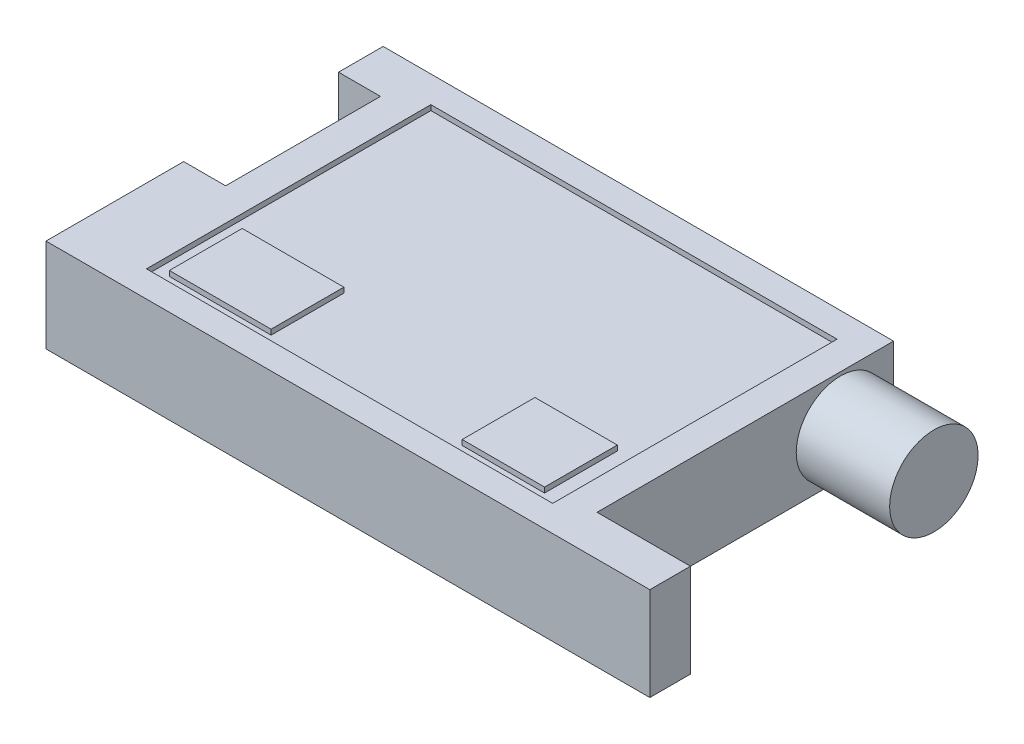
ISO-10303-21;
HEADER;
FILE_DESCRIPTION(('STEP AP214'),'2;1');
FILE_NAME('part.step','',(''),(''),'','','');
FILE_SCHEMA(('AUTOMOTIVE_DESIGN { 1 0 10303 214 1 1 1 1 }'));
ENDSEC;
DATA;
#1=APPLICATION_CONTEXT('core data for automotive mechanical design processes');
#2=APPLICATION_PROTOCOL_DEFINITION('international standard','automotive_design',2000,#1);
#3=PRODUCT_CONTEXT('',#1,'mechanical');
#4=PRODUCT('Part','Part','',(#3));
#5=PRODUCT_RELATED_PRODUCT_CATEGORY('part','',(#4));
#6=PRODUCT_DEFINITION_FORMATION('','',#4);
#7=PRODUCT_DEFINITION_CONTEXT('part definition',#1,'design');
#8=PRODUCT_DEFINITION('design','',#6,#7);
#9=PRODUCT_DEFINITION_SHAPE('','',#8);
#10=(LENGTH_UNIT() NAMED_UNIT(*) SI_UNIT(.MILLI.,.METRE.));
#11=(NAMED_UNIT(*) PLANE_ANGLE_UNIT() SI_UNIT($,.RADIAN.));
#12=(NAMED_UNIT(*) SI_UNIT($,.STERADIAN.) SOLID_ANGLE_UNIT());
#13=UNCERTAINTY_MEASURE_WITH_UNIT(LENGTH_MEASURE(1.E-05),#10,'distance_accuracy_value','');
#14=(GEOMETRIC_REPRESENTATION_CONTEXT(3) GLOBAL_UNCERTAINTY_ASSIGNED_CONTEXT((#13)) GLOBAL_UNIT_ASSIGNED_CONTEXT((#10,
#11,#12)) REPRESENTATION_CONTEXT('',''));
#15=CARTESIAN_POINT('',(0.,0.,0.));
#16=DIRECTION('',(0.,0.,1.));
#17=DIRECTION('',(1.,0.,0.));
#18=AXIS2_PLACEMENT_3D('',#15,#16,#17);
#19=CARTESIAN_POINT('',(0.,17.,0.));
#20=DIRECTION('',(0.,1.,0.));
#21=DIRECTION('',(0.,0.,1.));
#22=AXIS2_PLACEMENT_3D('',#19,#20,#21);
#23=PLANE('',#22);
#24=DIRECTION('',(1.,0.,0.));
#25=VECTOR('',#24,1.);
#26=CARTESIAN_POINT('',(17.5789290937729,17.,29.5927028688254));
#27=LINE('',#26,#25);
#28=CARTESIAN_POINT('',(17.5789290937729,17.,29.5927028688254));
#29=VERTEX_POINT('',#28);
#30=CARTESIAN_POINT('',(33.4416147487104,17.,29.5927028688254));
#31=VERTEX_POINT('',#30);
#32=EDGE_CURVE('E284',#29,#31,#27,.T.);
#33=ORIENTED_EDGE('',*,*,#32,.F.);
#34=DIRECTION('',(0.,0.,1.));
#35=VECTOR('',#34,1.);
#36=CARTESIAN_POINT('',(17.5789290937729,17.,15.578617873814));
#37=LINE('',#36,#35);
#38=CARTESIAN_POINT('',(17.5789290937729,17.,15.578617873814));
#39=VERTEX_POINT('',#38);
#40=EDGE_CURVE('E288',#39,#29,#37,.T.);
#41=ORIENTED_EDGE('',*,*,#40,.F.);
#42=DIRECTION('',(-1.,0.,0.));
#43=VECTOR('',#42,1.);
#44=CARTESIAN_POINT('',(17.5789290937729,17.,15.578617873814));
#45=LINE('',#44,#43);
#46=CARTESIAN_POINT('',(33.4416147487104,17.,15.578617873814));
#47=VERTEX_POINT('',#46);
#48=EDGE_CURVE('E276',#47,#39,#45,.T.);
#49=ORIENTED_EDGE('',*,*,#48,.F.);
#50=DIRECTION('',(0.,0.,-1.));
#51=VECTOR('',#50,1.);
#52=CARTESIAN_POINT('',(33.4416147487104,17.,15.578617873814));
#53=LINE('',#52,#51);
#54=EDGE_CURVE('E281',#31,#47,#53,.T.);
#55=ORIENTED_EDGE('',*,*,#54,.F.);
#56=EDGE_LOOP('',(#33,#41,#49,#55));
#57=FACE_BOUND('',#56,.T.);
#58=DIRECTION('',(-1.,0.,0.));
#59=VECTOR('',#58,1.);
#60=CARTESIAN_POINT('',(36.9450448076449,17.,-23.2440073529006));
#61=LINE('',#60,#59);
#62=CARTESIAN_POINT('',(36.9450448076449,17.,-23.2440073529006));
#63=VERTEX_POINT('',#62);
#64=CARTESIAN_POINT('',(-41.2893289979763,17.,-23.2440073529006));
#65=VERTEX_POINT('',#64);
#66=EDGE_CURVE('E308',#63,#65,#61,.T.);
#67=ORIENTED_EDGE('',*,*,#66,.T.);
#68=DIRECTION('',(0.,0.,1.));
#69=VECTOR('',#68,1.);
#70=CARTESIAN_POINT('',(-41.2893289979763,17.,-23.2440073529006));
#71=LINE('',#70,#69);
#72=CARTESIAN_POINT('',(-41.2893289979763,17.,31.5330929683171));
#73=VERTEX_POINT('',#72);
#74=EDGE_CURVE('E311',#65,#73,#71,.T.);
#75=ORIENTED_EDGE('',*,*,#74,.T.);
#76=DIRECTION('',(1.,0.,0.));
#77=VECTOR('',#76,1.);
#78=CARTESIAN_POINT('',(-41.2893289979763,17.,31.5330929683171));
#79=LINE('',#78,#77);
#80=CARTESIAN_POINT('',(36.9450448076449,17.,31.5330929683171));
#81=VERTEX_POINT('',#80);
#82=EDGE_CURVE('E315',#73,#81,#79,.T.);
#83=ORIENTED_EDGE('',*,*,#82,.T.);
#84=DIRECTION('',(0.,0.,-1.));
#85=VECTOR('',#84,1.);
#86=CARTESIAN_POINT('',(36.9450448076449,17.,31.5330929683171));
#87=LINE('',#86,#85);
#88=EDGE_CURVE('E318',#81,#63,#87,.T.);
#89=ORIENTED_EDGE('',*,*,#88,.T.);
#90=EDGE_LOOP('',(#67,#75,#83,#89));
#91=FACE_BOUND('',#90,.T.);
#92=DIRECTION('',(1.,0.,0.));
#93=VECTOR('',#92,1.);
#94=CARTESIAN_POINT('',(-38.8119047969582,17.,29.5927028688254));
#95=LINE('',#94,#93);
#96=CARTESIAN_POINT('',(-38.8119047969582,17.,29.5927028688254));
#97=VERTEX_POINT('',#96);
#98=CARTESIAN_POINT('',(-19.2267090731946,17.,29.5927028688254));
#99=VERTEX_POINT('',#98);
#100=EDGE_CURVE('E252',#97,#99,#95,.T.);
#101=ORIENTED_EDGE('',*,*,#100,.F.);
#102=DIRECTION('',(0.,0.,1.));
#103=VECTOR('',#102,1.);
#104=CARTESIAN_POINT('',(-38.8119047969582,17.,15.578617873814));
#105=LINE('',#104,#103);
#106=CARTESIAN_POINT('',(-38.8119047969582,17.,15.578617873814));
#107=VERTEX_POINT('',#106);
#108=EDGE_CURVE('E256',#107,#97,#105,.T.);
#109=ORIENTED_EDGE('',*,*,#108,.F.);
#110=DIRECTION('',(-1.,0.,0.));
#111=VECTOR('',#110,1.);
#112=CARTESIAN_POINT('',(-38.8119047969582,17.,15.578617873814));
#113=LINE('',#112,#111);
#114=CARTESIAN_POINT('',(-19.2267090731946,17.,15.578617873814));
#115=VERTEX_POINT('',#114);
#116=EDGE_CURVE('E244',#115,#107,#113,.T.);
#117=ORIENTED_EDGE('',*,*,#116,.F.);
#118=DIRECTION('',(0.,0.,-1.));
#119=VECTOR('',#118,1.);
#120=CARTESIAN_POINT('',(-19.2267090731946,17.,15.578617873814));
#121=LINE('',#120,#119);
#122=EDGE_CURVE('E249',#99,#115,#121,.T.);
#123=ORIENTED_EDGE('',*,*,#122,.F.);
#124=EDGE_LOOP('',(#101,#109,#117,#123));
#125=FACE_BOUND('',#124,.T.);
#126=ADVANCED_FACE('F33',(#57,#91,#125),#23,.T.);
#127=CARTESIAN_POINT('',(42.7052642554107,18.,-13.7559643184414));
#128=DIRECTION('',(-1.,0.,0.));
#129=DIRECTION('',(0.,0.,1.));
#130=AXIS2_PLACEMENT_3D('',#127,#128,#129);
#131=PLANE('',#130);
#132=DIRECTION('',(0.,0.,-1.));
#133=VECTOR('',#132,1.);
#134=CARTESIAN_POINT('',(42.7052642554107,0.,-13.7559643184414));
#135=LINE('',#134,#133);
#136=CARTESIAN_POINT('',(42.7052642554107,0.,28.7484593649253));
#137=VERTEX_POINT('',#136);
#138=CARTESIAN_POINT('',(42.7052642554107,0.,-28.3587111053649));
#139=VERTEX_POINT('',#138);
#140=EDGE_CURVE('E347',#137,#139,#135,.T.);
#141=ORIENTED_EDGE('',*,*,#140,.T.);
#142=DIRECTION('',(0.,-1.,0.));
#143=VECTOR('',#142,1.);
#144=CARTESIAN_POINT('',(42.7052642554107,18.,-28.3587111053649));
#145=LINE('',#144,#143);
#146=CARTESIAN_POINT('',(42.7052642554107,18.,-28.3587111053649));
#147=VERTEX_POINT('',#146);
#148=EDGE_CURVE('E365',#147,#139,#145,.T.);
#149=ORIENTED_EDGE('',*,*,#148,.F.);
#150=DIRECTION('',(0.,0.,-1.));
#151=VECTOR('',#150,1.);
#152=CARTESIAN_POINT('',(42.7052642554107,18.,28.7484593649253));
#153=LINE('',#152,#151);
#154=CARTESIAN_POINT('',(42.7052642554107,18.,28.7484593649253));
#155=VERTEX_POINT('',#154);
#156=EDGE_CURVE('E363',#155,#147,#153,.T.);
#157=ORIENTED_EDGE('',*,*,#156,.F.);
#158=DIRECTION('',(0.,-1.,0.));
#159=VECTOR('',#158,1.);
#160=CARTESIAN_POINT('',(42.7052642554107,18.,28.7484593649253));
#161=LINE('',#160,#159);
#162=EDGE_CURVE('E389',#155,#137,#161,.T.);
#163=ORIENTED_EDGE('',*,*,#162,.T.);
#164=EDGE_LOOP('',(#141,#149,#157,#163));
#165=FACE_BOUND('',#164,.T.);
#166=CARTESIAN_POINT('',(42.7052642554107,8.78099840539903,-18.1337047867629));
#167=DIRECTION('',(-1.,0.,0.));
#168=DIRECTION('',(0.,0.,1.));
#169=AXIS2_PLACEMENT_3D('',#166,#167,#168);
#170=CIRCLE('',#169,8.51668052111273);
#171=CARTESIAN_POINT('',(42.7052642554107,8.78099840539903,-9.61702426565018));
#172=VERTEX_POINT('',#171);
#173=EDGE_CURVE('E11',#172,#172,#170,.F.);
#174=ORIENTED_EDGE('',*,*,#173,.F.);
#175=EDGE_LOOP('',(#174));
#176=FACE_BOUND('',#175,.T.);
#177=ADVANCED_FACE('F436',(#165,#176),#131,.F.);
#178=CARTESIAN_POINT('',(42.7052642554107,18.,-28.3587111053649));
#179=DIRECTION('',(0.,0.,1.));
#180=DIRECTION('',(1.,0.,0.));
#181=AXIS2_PLACEMENT_3D('',#178,#179,#180);
#182=PLANE('',#181);
#183=DIRECTION('',(1.,0.,0.));
#184=VECTOR('',#183,1.);
#185=CARTESIAN_POINT('',(-47.5188498209383,4.02090009423084,-28.3587111053649));
#186=LINE('',#185,#184);
#187=CARTESIAN_POINT('',(-51.6294098232208,4.02090009423084,-28.3587111053649));
#188=VERTEX_POINT('',#187);
#189=CARTESIAN_POINT('',(-47.5188498209383,4.02090009423084,-28.3587111053649));
#190=VERTEX_POINT('',#189);
#191=EDGE_CURVE('E219',#188,#190,#186,.T.);
#192=ORIENTED_EDGE('',*,*,#191,.T.);
#193=DIRECTION('',(0.,1.,0.));
#194=VECTOR('',#193,1.);
#195=CARTESIAN_POINT('',(-47.5188498209383,4.02090009423084,-28.3587111053649));
#196=LINE('',#195,#194);
#197=CARTESIAN_POINT('',(-47.5188498209383,13.4253877681134,-28.3587111053649));
#198=VERTEX_POINT('',#197);
#199=EDGE_CURVE('E210',#190,#198,#196,.T.);
#200=ORIENTED_EDGE('',*,*,#199,.T.);
#201=DIRECTION('',(-1.,0.,0.));
#202=VECTOR('',#201,1.);
#203=CARTESIAN_POINT('',(-47.5188498209383,13.4253877681134,-28.3587111053649));
#204=LINE('',#203,#202);
#205=CARTESIAN_POINT('',(-51.6294098232208,13.4253877681134,-28.3587111053649));
#206=VERTEX_POINT('',#205);
#207=EDGE_CURVE('E222',#198,#206,#204,.T.);
#208=ORIENTED_EDGE('',*,*,#207,.T.);
#209=DIRECTION('',(0.,-1.,0.));
#210=VECTOR('',#209,1.);
#211=CARTESIAN_POINT('',(-51.6294098232208,4.02090009423084,-28.3587111053649));
#212=LINE('',#211,#210);
#213=EDGE_CURVE('E48',#206,#188,#212,.T.);
#214=ORIENTED_EDGE('',*,*,#213,.T.);
#215=EDGE_LOOP('',(#192,#200,#208,#214));
#216=FACE_BOUND('',#215,.T.);
#217=DIRECTION('',(-1.,0.,0.));
#218=VECTOR('',#217,1.);
#219=CARTESIAN_POINT('',(42.7052642554107,0.,-28.3587111053649));
#220=LINE('',#219,#218);
#221=CARTESIAN_POINT('',(-55.6025132208424,0.,-28.3587111053649));
#222=VERTEX_POINT('',#221);
#223=EDGE_CURVE('E342',#139,#222,#220,.T.);
#224=ORIENTED_EDGE('',*,*,#223,.T.);
#225=DIRECTION('',(0.,-1.,0.));
#226=VECTOR('',#225,1.);
#227=CARTESIAN_POINT('',(-55.6025132208424,18.,-28.3587111053649));
#228=LINE('',#227,#226);
#229=CARTESIAN_POINT('',(-55.6025132208424,18.,-28.3587111053649));
#230=VERTEX_POINT('',#229);
#231=EDGE_CURVE('E41',#230,#222,#228,.T.);
#232=ORIENTED_EDGE('',*,*,#231,.F.);
#233=DIRECTION('',(-1.,0.,0.));
#234=VECTOR('',#233,1.);
#235=CARTESIAN_POINT('',(42.7052642554107,18.,-28.3587111053649));
#236=LINE('',#235,#234);
#237=EDGE_CURVE('E343',#147,#230,#236,.T.);
#238=ORIENTED_EDGE('',*,*,#237,.F.);
#239=ORIENTED_EDGE('',*,*,#148,.T.);
#240=EDGE_LOOP('',(#224,#232,#238,#239));
#241=FACE_BOUND('',#240,.T.);
#242=ADVANCED_FACE('F35',(#216,#241),#182,.F.);
#243=CARTESIAN_POINT('',(-55.6025132208424,18.,-28.3587111053649));
#244=DIRECTION('',(1.,0.,0.));
#245=DIRECTION('',(0.,0.,-1.));
#246=AXIS2_PLACEMENT_3D('',#243,#244,#245);
#247=PLANE('',#246);
#248=DIRECTION('',(0.,0.,1.));
#249=VECTOR('',#248,1.);
#250=CARTESIAN_POINT('',(-55.6025132208424,0.,-28.3587111053649));
#251=LINE('',#250,#249);
#252=CARTESIAN_POINT('',(-55.6025132208424,0.,-19.7685554486213));
#253=VERTEX_POINT('',#252);
#254=EDGE_CURVE('E368',#222,#253,#251,.T.);
#255=ORIENTED_EDGE('',*,*,#254,.T.);
#256=DIRECTION('',(0.,-1.,0.));
#257=VECTOR('',#256,1.);
#258=CARTESIAN_POINT('',(-55.6025132208424,18.,-19.7685554486213));
#259=LINE('',#258,#257);
#260=CARTESIAN_POINT('',(-55.6025132208424,18.,-19.7685554486213));
#261=VERTEX_POINT('',#260);
#262=EDGE_CURVE('E409',#261,#253,#259,.T.);
#263=ORIENTED_EDGE('',*,*,#262,.F.);
#264=DIRECTION('',(0.,0.,1.));
#265=VECTOR('',#264,1.);
#266=CARTESIAN_POINT('',(-55.6025132208424,18.,-28.3587111053649));
#267=LINE('',#266,#265);
#268=EDGE_CURVE('E346',#230,#261,#267,.T.);
#269=ORIENTED_EDGE('',*,*,#268,.F.);
#270=ORIENTED_EDGE('',*,*,#231,.T.);
#271=EDGE_LOOP('',(#255,#263,#269,#270));
#272=FACE_BOUND('',#271,.T.);
#273=ADVANCED_FACE('F414',(#272),#247,.F.);
#274=CARTESIAN_POINT('',(-55.6025132208424,18.,-19.7685554486213));
#275=DIRECTION('',(0.,0.,-1.));
#276=DIRECTION('',(-1.,0.,0.));
#277=AXIS2_PLACEMENT_3D('',#274,#275,#276);
#278=PLANE('',#277);
#279=DIRECTION('',(0.,-1.,0.));
#280=VECTOR('',#279,1.);
#281=CARTESIAN_POINT('',(-47.5188498209383,18.,-19.7685554486213));
#282=LINE('',#281,#280);
#283=CARTESIAN_POINT('',(-47.5188498209383,4.02090009423084,-19.7685554486213));
#284=VERTEX_POINT('',#283);
#285=CARTESIAN_POINT('',(-47.5188498209383,0.,-19.7685554486213));
#286=VERTEX_POINT('',#285);
#287=EDGE_CURVE('E407',#284,#286,#282,.T.);
#288=ORIENTED_EDGE('',*,*,#287,.F.);
#289=DIRECTION('',(1.,0.,0.));
#290=VECTOR('',#289,1.);
#291=CARTESIAN_POINT('',(-47.5188498209383,4.02090009423084,-19.7685554486213));
#292=LINE('',#291,#290);
#293=CARTESIAN_POINT('',(-51.6294098232208,4.02090009423084,-19.7685554486213));
#294=VERTEX_POINT('',#293);
#295=EDGE_CURVE('E56',#294,#284,#292,.T.);
#296=ORIENTED_EDGE('',*,*,#295,.F.);
#297=DIRECTION('',(0.,-1.,0.));
#298=VECTOR('',#297,1.);
#299=CARTESIAN_POINT('',(-51.6294098232208,4.02090009423084,-19.7685554486213));
#300=LINE('',#299,#298);
#301=CARTESIAN_POINT('',(-51.6294098232208,13.4253877681134,-19.7685554486213));
#302=VERTEX_POINT('',#301);
#303=EDGE_CURVE('E229',#302,#294,#300,.T.);
#304=ORIENTED_EDGE('',*,*,#303,.F.);
#305=DIRECTION('',(-1.,0.,0.));
#306=VECTOR('',#305,1.);
#307=CARTESIAN_POINT('',(-47.5188498209383,13.4253877681134,-19.7685554486213));
#308=LINE('',#307,#306);
#309=CARTESIAN_POINT('',(-47.5188498209383,13.4253877681134,-19.7685554486213));
#310=VERTEX_POINT('',#309);
#311=EDGE_CURVE('E234',#310,#302,#308,.T.);
#312=ORIENTED_EDGE('',*,*,#311,.F.);
#313=CARTESIAN_POINT('',(-47.5188498209383,18.,-19.7685554486213));
#314=VERTEX_POINT('',#313);
#315=EDGE_CURVE('E214',#314,#310,#282,.T.);
#316=ORIENTED_EDGE('',*,*,#315,.F.);
#317=DIRECTION('',(1.,0.,0.));
#318=VECTOR('',#317,1.);
#319=CARTESIAN_POINT('',(-55.6025132208424,18.,-19.7685554486213));
#320=LINE('',#319,#318);
#321=EDGE_CURVE('E349',#261,#314,#320,.T.);
#322=ORIENTED_EDGE('',*,*,#321,.F.);
#323=ORIENTED_EDGE('',*,*,#262,.T.);
#324=DIRECTION('',(1.,0.,0.));
#325=VECTOR('',#324,1.);
#326=CARTESIAN_POINT('',(-55.6025132208424,0.,-19.7685554486213));
#327=LINE('',#326,#325);
#328=EDGE_CURVE('E370',#253,#286,#327,.T.);
#329=ORIENTED_EDGE('',*,*,#328,.T.);
#330=EDGE_LOOP('',(#288,#296,#304,#312,#316,#322,#323,#329));
#331=FACE_BOUND('',#330,.T.);
#332=ADVANCED_FACE('F427',(#331),#278,.F.);
#333=CARTESIAN_POINT('',(-47.5188498209383,18.,-19.7685554486213));
#334=DIRECTION('',(1.,0.,0.));
#335=DIRECTION('',(0.,0.,-1.));
#336=AXIS2_PLACEMENT_3D('',#333,#334,#335);
#337=PLANE('',#336);
#338=DIRECTION('',(0.,0.,1.));
#339=VECTOR('',#338,1.);
#340=CARTESIAN_POINT('',(-47.5188498209383,0.,-19.7685554486213));
#341=LINE('',#340,#339);
#342=CARTESIAN_POINT('',(-47.5188498209383,0.,10.055277404911));
#343=VERTEX_POINT('',#342);
#344=EDGE_CURVE('E373',#286,#343,#341,.T.);
#345=ORIENTED_EDGE('',*,*,#344,.T.);
#346=DIRECTION('',(0.,-1.,0.));
#347=VECTOR('',#346,1.);
#348=CARTESIAN_POINT('',(-47.5188498209383,18.,10.055277404911));
#349=LINE('',#348,#347);
#350=CARTESIAN_POINT('',(-47.5188498209383,18.,10.055277404911));
#351=VERTEX_POINT('',#350);
#352=EDGE_CURVE('E404',#351,#343,#349,.T.);
#353=ORIENTED_EDGE('',*,*,#352,.F.);
#354=DIRECTION('',(0.,0.,1.));
#355=VECTOR('',#354,1.);
#356=CARTESIAN_POINT('',(-47.5188498209383,18.,-19.7685554486213));
#357=LINE('',#356,#355);
#358=EDGE_CURVE('E351',#314,#351,#357,.T.);
#359=ORIENTED_EDGE('',*,*,#358,.F.);
#360=ORIENTED_EDGE('',*,*,#315,.T.);
#361=DIRECTION('',(0.,0.,1.));
#362=VECTOR('',#361,1.);
#363=CARTESIAN_POINT('',(-47.5188498209383,13.4253877681134,-28.3587111053649));
#364=LINE('',#363,#362);
#365=EDGE_CURVE('E206',#198,#310,#364,.T.);
#366=ORIENTED_EDGE('',*,*,#365,.F.);
#367=ORIENTED_EDGE('',*,*,#199,.F.);
#368=DIRECTION('',(0.,0.,1.));
#369=VECTOR('',#368,1.);
#370=CARTESIAN_POINT('',(-47.5188498209383,4.02090009423084,-28.3587111053649));
#371=LINE('',#370,#369);
#372=EDGE_CURVE('E238',#190,#284,#371,.T.);
#373=ORIENTED_EDGE('',*,*,#372,.T.);
#374=ORIENTED_EDGE('',*,*,#287,.T.);
#375=EDGE_LOOP('',(#345,#353,#359,#360,#366,#367,#373,#374));
#376=FACE_BOUND('',#375,.T.);
#377=ADVANCED_FACE('F208',(#376),#337,.F.);
#378=CARTESIAN_POINT('',(-47.5188498209383,18.,10.055277404911));
#379=DIRECTION('',(0.,0.,1.));
#380=DIRECTION('',(1.,0.,0.));
#381=AXIS2_PLACEMENT_3D('',#378,#379,#380);
#382=PLANE('',#381);
#383=DIRECTION('',(-1.,0.,0.));
#384=VECTOR('',#383,1.);
#385=CARTESIAN_POINT('',(-47.5188498209383,0.,10.055277404911));
#386=LINE('',#385,#384);
#387=CARTESIAN_POINT('',(-55.6025132208424,0.,10.055277404911));
#388=VERTEX_POINT('',#387);
#389=EDGE_CURVE('E375',#343,#388,#386,.T.);
#390=ORIENTED_EDGE('',*,*,#389,.T.);
#391=DIRECTION('',(0.,-1.,0.));
#392=VECTOR('',#391,1.);
#393=CARTESIAN_POINT('',(-55.6025132208424,18.,10.055277404911));
#394=LINE('',#393,#392);
#395=CARTESIAN_POINT('',(-55.6025132208424,18.,10.055277404911));
#396=VERTEX_POINT('',#395);
#397=EDGE_CURVE('E401',#396,#388,#394,.T.);
#398=ORIENTED_EDGE('',*,*,#397,.F.);
#399=DIRECTION('',(-1.,0.,0.));
#400=VECTOR('',#399,1.);
#401=CARTESIAN_POINT('',(-47.5188498209383,18.,10.055277404911));
#402=LINE('',#401,#400);
#403=EDGE_CURVE('E353',#351,#396,#402,.T.);
#404=ORIENTED_EDGE('',*,*,#403,.F.);
#405=ORIENTED_EDGE('',*,*,#352,.T.);
#406=EDGE_LOOP('',(#390,#398,#404,#405));
#407=FACE_BOUND('',#406,.T.);
#408=ADVANCED_FACE('F457',(#407),#382,.F.);
#409=CARTESIAN_POINT('',(-55.6025132208424,18.,10.055277404911));
#410=DIRECTION('',(1.,0.,0.));
#411=DIRECTION('',(0.,0.,-1.));
#412=AXIS2_PLACEMENT_3D('',#409,#410,#411);
#413=PLANE('',#412);
#414=DIRECTION('',(0.,0.,1.));
#415=VECTOR('',#414,1.);
#416=CARTESIAN_POINT('',(-55.6025132208424,0.,10.055277404911));
#417=LINE('',#416,#415);
#418=CARTESIAN_POINT('',(-55.6025132208424,0.,36.5713594293487));
#419=VERTEX_POINT('',#418);
#420=EDGE_CURVE('E377',#388,#419,#417,.T.);
#421=ORIENTED_EDGE('',*,*,#420,.T.);
#422=DIRECTION('',(0.,-1.,0.));
#423=VECTOR('',#422,1.);
#424=CARTESIAN_POINT('',(-55.6025132208424,18.,36.5713594293487));
#425=LINE('',#424,#423);
#426=CARTESIAN_POINT('',(-55.6025132208424,18.,36.5713594293487));
#427=VERTEX_POINT('',#426);
#428=EDGE_CURVE('E398',#427,#419,#425,.T.);
#429=ORIENTED_EDGE('',*,*,#428,.F.);
#430=DIRECTION('',(0.,0.,1.));
#431=VECTOR('',#430,1.);
#432=CARTESIAN_POINT('',(-55.6025132208424,18.,10.055277404911));
#433=LINE('',#432,#431);
#434=EDGE_CURVE('E355',#396,#427,#433,.T.);
#435=ORIENTED_EDGE('',*,*,#434,.F.);
#436=ORIENTED_EDGE('',*,*,#397,.T.);
#437=EDGE_LOOP('',(#421,#429,#435,#436));
#438=FACE_BOUND('',#437,.T.);
#439=ADVANCED_FACE('F454',(#438),#413,.F.);
#440=CARTESIAN_POINT('',(-55.6025132208424,18.,36.5713594293487));
#441=DIRECTION('',(0.,0.,-1.));
#442=DIRECTION('',(-1.,0.,0.));
#443=AXIS2_PLACEMENT_3D('',#440,#441,#442);
#444=PLANE('',#443);
#445=DIRECTION('',(1.,0.,0.));
#446=VECTOR('',#445,1.);
#447=CARTESIAN_POINT('',(-55.6025132208424,0.,36.5713594293487));
#448=LINE('',#447,#446);
#449=CARTESIAN_POINT('',(60.6979344035843,0.,36.5713594293487));
#450=VERTEX_POINT('',#449);
#451=EDGE_CURVE('E379',#419,#450,#448,.T.);
#452=ORIENTED_EDGE('',*,*,#451,.T.);
#453=DIRECTION('',(0.,-1.,0.));
#454=VECTOR('',#453,1.);
#455=CARTESIAN_POINT('',(60.6979344035843,18.,36.5713594293487));
#456=LINE('',#455,#454);
#457=CARTESIAN_POINT('',(60.6979344035843,18.,36.5713594293487));
#458=VERTEX_POINT('',#457);
#459=EDGE_CURVE('E395',#458,#450,#456,.T.);
#460=ORIENTED_EDGE('',*,*,#459,.F.);
#461=DIRECTION('',(1.,0.,0.));
#462=VECTOR('',#461,1.);
#463=CARTESIAN_POINT('',(-55.6025132208424,18.,36.5713594293487));
#464=LINE('',#463,#462);
#465=EDGE_CURVE('E357',#427,#458,#464,.T.);
#466=ORIENTED_EDGE('',*,*,#465,.F.);
#467=ORIENTED_EDGE('',*,*,#428,.T.);
#468=EDGE_LOOP('',(#452,#460,#466,#467));
#469=FACE_BOUND('',#468,.T.);
#470=ADVANCED_FACE('F450',(#469),#444,.F.);
#471=CARTESIAN_POINT('',(60.6979344035843,18.,36.5713594293487));
#472=DIRECTION('',(-1.,0.,0.));
#473=DIRECTION('',(0.,0.,1.));
#474=AXIS2_PLACEMENT_3D('',#471,#472,#473);
#475=PLANE('',#474);
#476=DIRECTION('',(0.,0.,-1.));
#477=VECTOR('',#476,1.);
#478=CARTESIAN_POINT('',(60.6979344035843,0.,36.5713594293487));
#479=LINE('',#478,#477);
#480=CARTESIAN_POINT('',(60.6979344035843,0.,28.7484593649253));
#481=VERTEX_POINT('',#480);
#482=EDGE_CURVE('E381',#450,#481,#479,.T.);
#483=ORIENTED_EDGE('',*,*,#482,.T.);
#484=DIRECTION('',(0.,-1.,0.));
#485=VECTOR('',#484,1.);
#486=CARTESIAN_POINT('',(60.6979344035843,18.,28.7484593649253));
#487=LINE('',#486,#485);
#488=CARTESIAN_POINT('',(60.6979344035843,18.,28.7484593649253));
#489=VERTEX_POINT('',#488);
#490=EDGE_CURVE('E392',#489,#481,#487,.T.);
#491=ORIENTED_EDGE('',*,*,#490,.F.);
#492=DIRECTION('',(0.,0.,-1.));
#493=VECTOR('',#492,1.);
#494=CARTESIAN_POINT('',(60.6979344035843,18.,36.5713594293487));
#495=LINE('',#494,#493);
#496=EDGE_CURVE('E359',#458,#489,#495,.T.);
#497=ORIENTED_EDGE('',*,*,#496,.F.);
#498=ORIENTED_EDGE('',*,*,#459,.T.);
#499=EDGE_LOOP('',(#483,#491,#497,#498));
#500=FACE_BOUND('',#499,.T.);
#501=ADVANCED_FACE('F445',(#500),#475,.F.);
#502=CARTESIAN_POINT('',(60.6979344035843,18.,28.7484593649253));
#503=DIRECTION('',(0.,0.,1.));
#504=DIRECTION('',(1.,0.,0.));
#505=AXIS2_PLACEMENT_3D('',#502,#503,#504);
#506=PLANE('',#505);
#507=DIRECTION('',(-1.,0.,0.));
#508=VECTOR('',#507,1.);
#509=CARTESIAN_POINT('',(60.6979344035843,0.,28.7484593649253));
#510=LINE('',#509,#508);
#511=EDGE_CURVE('E383',#481,#137,#510,.T.);
#512=ORIENTED_EDGE('',*,*,#511,.T.);
#513=ORIENTED_EDGE('',*,*,#162,.F.);
#514=DIRECTION('',(-1.,0.,0.));
#515=VECTOR('',#514,1.);
#516=CARTESIAN_POINT('',(60.6979344035843,18.,28.7484593649253));
#517=LINE('',#516,#515);
#518=EDGE_CURVE('E361',#489,#155,#517,.T.);
#519=ORIENTED_EDGE('',*,*,#518,.F.);
#520=ORIENTED_EDGE('',*,*,#490,.T.);
#521=EDGE_LOOP('',(#512,#513,#519,#520));
#522=FACE_BOUND('',#521,.T.);
#523=ADVANCED_FACE('F439',(#522),#506,.F.);
#524=CARTESIAN_POINT('',(0.,18.,0.));
#525=DIRECTION('',(0.,1.,0.));
#526=DIRECTION('',(0.,0.,1.));
#527=AXIS2_PLACEMENT_3D('',#524,#525,#526);
#528=PLANE('',#527);
#529=DIRECTION('',(-1.,0.,0.));
#530=VECTOR('',#529,1.);
#531=CARTESIAN_POINT('',(36.9450448076449,18.,-23.2440073529006));
#532=LINE('',#531,#530);
#533=CARTESIAN_POINT('',(36.9450448076449,18.,-23.2440073529006));
#534=VERTEX_POINT('',#533);
#535=CARTESIAN_POINT('',(-41.2893289979763,18.,-23.2440073529006));
#536=VERTEX_POINT('',#535);
#537=EDGE_CURVE('E294',#534,#536,#532,.T.);
#538=ORIENTED_EDGE('',*,*,#537,.F.);
#539=DIRECTION('',(0.,0.,-1.));
#540=VECTOR('',#539,1.);
#541=CARTESIAN_POINT('',(36.9450448076449,18.,31.5330929683171));
#542=LINE('',#541,#540);
#543=CARTESIAN_POINT('',(36.9450448076449,18.,31.5330929683171));
#544=VERTEX_POINT('',#543);
#545=EDGE_CURVE('E312',#544,#534,#542,.T.);
#546=ORIENTED_EDGE('',*,*,#545,.F.);
#547=DIRECTION('',(1.,0.,0.));
#548=VECTOR('',#547,1.);
#549=CARTESIAN_POINT('',(-41.2893289979763,18.,31.5330929683171));
#550=LINE('',#549,#548);
#551=CARTESIAN_POINT('',(-41.2893289979763,18.,31.5330929683171));
#552=VERTEX_POINT('',#551);
#553=EDGE_CURVE('E326',#552,#544,#550,.T.);
#554=ORIENTED_EDGE('',*,*,#553,.F.);
#555=DIRECTION('',(0.,0.,1.));
#556=VECTOR('',#555,1.);
#557=CARTESIAN_POINT('',(-41.2893289979763,18.,-23.2440073529006));
#558=LINE('',#557,#556);
#559=EDGE_CURVE('E323',#536,#552,#558,.T.);
#560=ORIENTED_EDGE('',*,*,#559,.F.);
#561=EDGE_LOOP('',(#538,#546,#554,#560));
#562=FACE_BOUND('',#561,.T.);
#563=ORIENTED_EDGE('',*,*,#237,.T.);
#564=ORIENTED_EDGE('',*,*,#268,.T.);
#565=ORIENTED_EDGE('',*,*,#321,.T.);
#566=ORIENTED_EDGE('',*,*,#358,.T.);
#567=ORIENTED_EDGE('',*,*,#403,.T.);
#568=ORIENTED_EDGE('',*,*,#434,.T.);
#569=ORIENTED_EDGE('',*,*,#465,.T.);
#570=ORIENTED_EDGE('',*,*,#496,.T.);
#571=ORIENTED_EDGE('',*,*,#518,.T.);
#572=ORIENTED_EDGE('',*,*,#156,.T.);
#573=EDGE_LOOP('',(#563,#564,#565,#566,#567,#568,#569,#570,#571,#572));
#574=FACE_BOUND('',#573,.T.);
#575=ADVANCED_FACE('F430',(#562,#574),#528,.T.);
#576=CARTESIAN_POINT('',(0.,0.,0.));
#577=DIRECTION('',(0.,1.,0.));
#578=DIRECTION('',(0.,0.,1.));
#579=AXIS2_PLACEMENT_3D('',#576,#577,#578);
#580=PLANE('',#579);
#581=ORIENTED_EDGE('',*,*,#223,.F.);
#582=ORIENTED_EDGE('',*,*,#140,.F.);
#583=ORIENTED_EDGE('',*,*,#511,.F.);
#584=ORIENTED_EDGE('',*,*,#482,.F.);
#585=ORIENTED_EDGE('',*,*,#451,.F.);
#586=ORIENTED_EDGE('',*,*,#420,.F.);
#587=ORIENTED_EDGE('',*,*,#389,.F.);
#588=ORIENTED_EDGE('',*,*,#344,.F.);
#589=ORIENTED_EDGE('',*,*,#328,.F.);
#590=ORIENTED_EDGE('',*,*,#254,.F.);
#591=EDGE_LOOP('',(#581,#582,#583,#584,#585,#586,#587,#588,#589,#590));
#592=FACE_BOUND('',#591,.T.);
#593=ADVANCED_FACE('F420',(#592),#580,.F.);
#594=CARTESIAN_POINT('',(84.7867446022971,8.78099840539903,-18.1337047867629));
#595=DIRECTION('',(-1.,0.,0.));
#596=DIRECTION('',(0.,0.,1.));
#597=AXIS2_PLACEMENT_3D('',#594,#595,#596);
#598=CYLINDRICAL_SURFACE('',#597,8.51668052111273);
#599=CARTESIAN_POINT('',(60.6979344035843,8.78099840539903,-18.1337047867629));
#600=DIRECTION('',(-1.,0.,0.));
#601=DIRECTION('',(0.,0.,1.));
#602=AXIS2_PLACEMENT_3D('',#599,#600,#601);
#603=CIRCLE('',#602,8.51668052111273);
#604=CARTESIAN_POINT('',(60.6979344035843,8.78099840539903,-9.61702426565018));
#605=VERTEX_POINT('',#604);
#606=EDGE_CURVE('E333',#605,#605,#603,.T.);
#607=ORIENTED_EDGE('',*,*,#606,.T.);
#608=EDGE_LOOP('',(#607));
#609=FACE_BOUND('',#608,.T.);
#610=ORIENTED_EDGE('',*,*,#173,.T.);
#611=EDGE_LOOP('',(#610));
#612=FACE_BOUND('',#611,.T.);
#613=ADVANCED_FACE('F504',(#609,#612),#598,.T.);
#614=CARTESIAN_POINT('',(60.6979344035843,18.,36.5713594293487));
#615=DIRECTION('',(-1.,0.,0.));
#616=DIRECTION('',(0.,0.,1.));
#617=AXIS2_PLACEMENT_3D('',#614,#615,#616);
#618=PLANE('',#617);
#619=ORIENTED_EDGE('',*,*,#606,.F.);
#620=EDGE_LOOP('',(#619));
#621=FACE_BOUND('',#620,.T.);
#622=ADVANCED_FACE('F500',(#621),#618,.F.);
#623=CARTESIAN_POINT('',(36.9450448076449,17.,-23.2440073529006));
#624=DIRECTION('',(0.,0.,-1.));
#625=DIRECTION('',(-1.,0.,0.));
#626=AXIS2_PLACEMENT_3D('',#623,#624,#625);
#627=PLANE('',#626);
#628=ORIENTED_EDGE('',*,*,#537,.T.);
#629=DIRECTION('',(0.,1.,0.));
#630=VECTOR('',#629,1.);
#631=CARTESIAN_POINT('',(-41.2893289979763,17.,-23.2440073529006));
#632=LINE('',#631,#630);
#633=EDGE_CURVE('E321',#65,#536,#632,.T.);
#634=ORIENTED_EDGE('',*,*,#633,.F.);
#635=ORIENTED_EDGE('',*,*,#66,.F.);
#636=DIRECTION('',(0.,1.,0.));
#637=VECTOR('',#636,1.);
#638=CARTESIAN_POINT('',(36.9450448076449,17.,-23.2440073529006));
#639=LINE('',#638,#637);
#640=EDGE_CURVE('E331',#63,#534,#639,.T.);
#641=ORIENTED_EDGE('',*,*,#640,.T.);
#642=EDGE_LOOP('',(#628,#634,#635,#641));
#643=FACE_BOUND('',#642,.T.);
#644=ADVANCED_FACE('F488',(#643),#627,.F.);
#645=CARTESIAN_POINT('',(36.9450448076449,17.,31.5330929683171));
#646=DIRECTION('',(1.,0.,0.));
#647=DIRECTION('',(0.,0.,-1.));
#648=AXIS2_PLACEMENT_3D('',#645,#646,#647);
#649=PLANE('',#648);
#650=ORIENTED_EDGE('',*,*,#545,.T.);
#651=ORIENTED_EDGE('',*,*,#640,.F.);
#652=ORIENTED_EDGE('',*,*,#88,.F.);
#653=DIRECTION('',(0.,1.,0.));
#654=VECTOR('',#653,1.);
#655=CARTESIAN_POINT('',(36.9450448076449,17.,31.5330929683171));
#656=LINE('',#655,#654);
#657=EDGE_CURVE('E334',#81,#544,#656,.T.);
#658=ORIENTED_EDGE('',*,*,#657,.T.);
#659=EDGE_LOOP('',(#650,#651,#652,#658));
#660=FACE_BOUND('',#659,.T.);
#661=ADVANCED_FACE('F484',(#660),#649,.F.);
#662=CARTESIAN_POINT('',(-41.2893289979763,17.,31.5330929683171));
#663=DIRECTION('',(0.,0.,1.));
#664=DIRECTION('',(1.,0.,0.));
#665=AXIS2_PLACEMENT_3D('',#662,#663,#664);
#666=PLANE('',#665);
#667=ORIENTED_EDGE('',*,*,#553,.T.);
#668=ORIENTED_EDGE('',*,*,#657,.F.);
#669=ORIENTED_EDGE('',*,*,#82,.F.);
#670=DIRECTION('',(0.,1.,0.));
#671=VECTOR('',#670,1.);
#672=CARTESIAN_POINT('',(-41.2893289979763,17.,31.5330929683171));
#673=LINE('',#672,#671);
#674=EDGE_CURVE('E336',#73,#552,#673,.T.);
#675=ORIENTED_EDGE('',*,*,#674,.T.);
#676=EDGE_LOOP('',(#667,#668,#669,#675));
#677=FACE_BOUND('',#676,.T.);
#678=ADVANCED_FACE('F487',(#677),#666,.F.);
#679=CARTESIAN_POINT('',(-41.2893289979763,17.,-23.2440073529006));
#680=DIRECTION('',(-1.,0.,0.));
#681=DIRECTION('',(0.,0.,1.));
#682=AXIS2_PLACEMENT_3D('',#679,#680,#681);
#683=PLANE('',#682);
#684=ORIENTED_EDGE('',*,*,#559,.T.);
#685=ORIENTED_EDGE('',*,*,#674,.F.);
#686=ORIENTED_EDGE('',*,*,#74,.F.);
#687=ORIENTED_EDGE('',*,*,#633,.T.);
#688=EDGE_LOOP('',(#684,#685,#686,#687));
#689=FACE_BOUND('',#688,.T.);
#690=ADVANCED_FACE('F492',(#689),#683,.F.);
#691=CARTESIAN_POINT('',(17.5789290937729,42.0826591095239,15.578617873814));
#692=DIRECTION('',(1.,0.,0.));
#693=DIRECTION('',(0.,0.,-1.));
#694=AXIS2_PLACEMENT_3D('',#691,#692,#693);
#695=PLANE('',#694);
#696=DIRECTION('',(0.,0.,1.));
#697=VECTOR('',#696,1.);
#698=CARTESIAN_POINT('',(17.5789290937729,18.,15.578617873814));
#699=LINE('',#698,#697);
#700=CARTESIAN_POINT('',(17.5789290937729,18.,15.578617873814));
#701=VERTEX_POINT('',#700);
#702=CARTESIAN_POINT('',(17.5789290937729,18.,29.5927028688254));
#703=VERTEX_POINT('',#702);
#704=EDGE_CURVE('E298',#701,#703,#699,.T.);
#705=ORIENTED_EDGE('',*,*,#704,.F.);
#706=DIRECTION('',(0.,-1.,0.));
#707=VECTOR('',#706,1.);
#708=CARTESIAN_POINT('',(17.5789290937729,42.0826591095239,15.578617873814));
#709=LINE('',#708,#707);
#710=EDGE_CURVE('E262',#701,#39,#709,.T.);
#711=ORIENTED_EDGE('',*,*,#710,.T.);
#712=ORIENTED_EDGE('',*,*,#40,.T.);
#713=DIRECTION('',(0.,-1.,0.));
#714=VECTOR('',#713,1.);
#715=CARTESIAN_POINT('',(17.5789290937729,42.0826591095239,29.5927028688254));
#716=LINE('',#715,#714);
#717=EDGE_CURVE('E287',#703,#29,#716,.T.);
#718=ORIENTED_EDGE('',*,*,#717,.F.);
#719=EDGE_LOOP('',(#705,#711,#712,#718));
#720=FACE_BOUND('',#719,.T.);
#721=ADVANCED_FACE('F496',(#720),#695,.F.);
#722=CARTESIAN_POINT('',(17.5789290937729,42.0826591095239,29.5927028688254));
#723=DIRECTION('',(0.,0.,-1.));
#724=DIRECTION('',(-1.,0.,0.));
#725=AXIS2_PLACEMENT_3D('',#722,#723,#724);
#726=PLANE('',#725);
#727=DIRECTION('',(1.,0.,0.));
#728=VECTOR('',#727,1.);
#729=CARTESIAN_POINT('',(17.5789290937729,18.,29.5927028688254));
#730=LINE('',#729,#728);
#731=CARTESIAN_POINT('',(33.4416147487104,18.,29.5927028688254));
#732=VERTEX_POINT('',#731);
#733=EDGE_CURVE('E295',#703,#732,#730,.T.);
#734=ORIENTED_EDGE('',*,*,#733,.F.);
#735=ORIENTED_EDGE('',*,*,#717,.T.);
#736=ORIENTED_EDGE('',*,*,#32,.T.);
#737=DIRECTION('',(0.,-1.,0.));
#738=VECTOR('',#737,1.);
#739=CARTESIAN_POINT('',(33.4416147487104,42.0826591095239,29.5927028688254));
#740=LINE('',#739,#738);
#741=EDGE_CURVE('E283',#732,#31,#740,.T.);
#742=ORIENTED_EDGE('',*,*,#741,.F.);
#743=EDGE_LOOP('',(#734,#735,#736,#742));
#744=FACE_BOUND('',#743,.T.);
#745=ADVANCED_FACE('F600',(#744),#726,.F.);
#746=CARTESIAN_POINT('',(33.4416147487104,42.0826591095239,15.578617873814));
#747=DIRECTION('',(-1.,0.,0.));
#748=DIRECTION('',(0.,0.,1.));
#749=AXIS2_PLACEMENT_3D('',#746,#747,#748);
#750=PLANE('',#749);
#751=DIRECTION('',(0.,0.,-1.));
#752=VECTOR('',#751,1.);
#753=CARTESIAN_POINT('',(33.4416147487104,18.,15.578617873814));
#754=LINE('',#753,#752);
#755=CARTESIAN_POINT('',(33.4416147487104,18.,15.578617873814));
#756=VERTEX_POINT('',#755);
#757=EDGE_CURVE('E291',#732,#756,#754,.T.);
#758=ORIENTED_EDGE('',*,*,#757,.F.);
#759=ORIENTED_EDGE('',*,*,#741,.T.);
#760=ORIENTED_EDGE('',*,*,#54,.T.);
#761=DIRECTION('',(0.,-1.,0.));
#762=VECTOR('',#761,1.);
#763=CARTESIAN_POINT('',(33.4416147487104,42.0826591095239,15.578617873814));
#764=LINE('',#763,#762);
#765=EDGE_CURVE('E280',#756,#47,#764,.T.);
#766=ORIENTED_EDGE('',*,*,#765,.F.);
#767=EDGE_LOOP('',(#758,#759,#760,#766));
#768=FACE_BOUND('',#767,.T.);
#769=ADVANCED_FACE('F609',(#768),#750,.F.);
#770=CARTESIAN_POINT('',(17.5789290937729,42.0826591095239,15.578617873814));
#771=DIRECTION('',(0.,0.,1.));
#772=DIRECTION('',(1.,0.,0.));
#773=AXIS2_PLACEMENT_3D('',#770,#771,#772);
#774=PLANE('',#773);
#775=DIRECTION('',(-1.,0.,0.));
#776=VECTOR('',#775,1.);
#777=CARTESIAN_POINT('',(17.5789290937729,18.,15.578617873814));
#778=LINE('',#777,#776);
#779=EDGE_CURVE('E279',#756,#701,#778,.T.);
#780=ORIENTED_EDGE('',*,*,#779,.F.);
#781=ORIENTED_EDGE('',*,*,#765,.T.);
#782=ORIENTED_EDGE('',*,*,#48,.T.);
#783=ORIENTED_EDGE('',*,*,#710,.F.);
#784=EDGE_LOOP('',(#780,#781,#782,#783));
#785=FACE_BOUND('',#784,.T.);
#786=ADVANCED_FACE('F619',(#785),#774,.F.);
#787=CARTESIAN_POINT('',(0.,18.,0.));
#788=DIRECTION('',(0.,1.,0.));
#789=DIRECTION('',(0.,0.,1.));
#790=AXIS2_PLACEMENT_3D('',#787,#788,#789);
#791=PLANE('',#790);
#792=ORIENTED_EDGE('',*,*,#779,.T.);
#793=ORIENTED_EDGE('',*,*,#704,.T.);
#794=ORIENTED_EDGE('',*,*,#733,.T.);
#795=ORIENTED_EDGE('',*,*,#757,.T.);
#796=EDGE_LOOP('',(#792,#793,#794,#795));
#797=FACE_BOUND('',#796,.T.);
#798=ADVANCED_FACE('F482',(#797),#791,.T.);
#799=CARTESIAN_POINT('',(-38.8119047969582,42.0826591095239,15.578617873814));
#800=DIRECTION('',(1.,0.,0.));
#801=DIRECTION('',(0.,0.,-1.));
#802=AXIS2_PLACEMENT_3D('',#799,#800,#801);
#803=PLANE('',#802);
#804=DIRECTION('',(0.,0.,1.));
#805=VECTOR('',#804,1.);
#806=CARTESIAN_POINT('',(-38.8119047969582,18.,15.578617873814));
#807=LINE('',#806,#805);
#808=CARTESIAN_POINT('',(-38.8119047969582,18.,15.578617873814));
#809=VERTEX_POINT('',#808);
#810=CARTESIAN_POINT('',(-38.8119047969582,18.,29.5927028688254));
#811=VERTEX_POINT('',#810);
#812=EDGE_CURVE('E266',#809,#811,#807,.T.);
#813=ORIENTED_EDGE('',*,*,#812,.F.);
#814=DIRECTION('',(0.,-1.,0.));
#815=VECTOR('',#814,1.);
#816=CARTESIAN_POINT('',(-38.8119047969582,42.0826591095239,15.578617873814));
#817=LINE('',#816,#815);
#818=EDGE_CURVE('E240',#809,#107,#817,.T.);
#819=ORIENTED_EDGE('',*,*,#818,.T.);
#820=ORIENTED_EDGE('',*,*,#108,.T.);
#821=DIRECTION('',(0.,-1.,0.));
#822=VECTOR('',#821,1.);
#823=CARTESIAN_POINT('',(-38.8119047969582,42.0826591095239,29.5927028688254));
#824=LINE('',#823,#822);
#825=EDGE_CURVE('E255',#811,#97,#824,.T.);
#826=ORIENTED_EDGE('',*,*,#825,.F.);
#827=EDGE_LOOP('',(#813,#819,#820,#826));
#828=FACE_BOUND('',#827,.T.);
#829=ADVANCED_FACE('F638',(#828),#803,.F.);
#830=CARTESIAN_POINT('',(-38.8119047969582,42.0826591095239,29.5927028688254));
#831=DIRECTION('',(0.,0.,-1.));
#832=DIRECTION('',(-1.,0.,0.));
#833=AXIS2_PLACEMENT_3D('',#830,#831,#832);
#834=PLANE('',#833);
#835=DIRECTION('',(1.,0.,0.));
#836=VECTOR('',#835,1.);
#837=CARTESIAN_POINT('',(-38.8119047969582,18.,29.5927028688254));
#838=LINE('',#837,#836);
#839=CARTESIAN_POINT('',(-19.2267090731946,18.,29.5927028688254));
#840=VERTEX_POINT('',#839);
#841=EDGE_CURVE('E263',#811,#840,#838,.T.);
#842=ORIENTED_EDGE('',*,*,#841,.F.);
#843=ORIENTED_EDGE('',*,*,#825,.T.);
#844=ORIENTED_EDGE('',*,*,#100,.T.);
#845=DIRECTION('',(0.,-1.,0.));
#846=VECTOR('',#845,1.);
#847=CARTESIAN_POINT('',(-19.2267090731946,42.0826591095239,29.5927028688254));
#848=LINE('',#847,#846);
#849=EDGE_CURVE('E251',#840,#99,#848,.T.);
#850=ORIENTED_EDGE('',*,*,#849,.F.);
#851=EDGE_LOOP('',(#842,#843,#844,#850));
#852=FACE_BOUND('',#851,.T.);
#853=ADVANCED_FACE('F647',(#852),#834,.F.);
#854=CARTESIAN_POINT('',(-19.2267090731946,42.0826591095239,15.578617873814));
#855=DIRECTION('',(-1.,0.,0.));
#856=DIRECTION('',(0.,0.,1.));
#857=AXIS2_PLACEMENT_3D('',#854,#855,#856);
#858=PLANE('',#857);
#859=DIRECTION('',(0.,0.,-1.));
#860=VECTOR('',#859,1.);
#861=CARTESIAN_POINT('',(-19.2267090731946,18.,15.578617873814));
#862=LINE('',#861,#860);
#863=CARTESIAN_POINT('',(-19.2267090731946,18.,15.578617873814));
#864=VERTEX_POINT('',#863);
#865=EDGE_CURVE('E259',#840,#864,#862,.T.);
#866=ORIENTED_EDGE('',*,*,#865,.F.);
#867=ORIENTED_EDGE('',*,*,#849,.T.);
#868=ORIENTED_EDGE('',*,*,#122,.T.);
#869=DIRECTION('',(0.,-1.,0.));
#870=VECTOR('',#869,1.);
#871=CARTESIAN_POINT('',(-19.2267090731946,42.0826591095239,15.578617873814));
#872=LINE('',#871,#870);
#873=EDGE_CURVE('E248',#864,#115,#872,.T.);
#874=ORIENTED_EDGE('',*,*,#873,.F.);
#875=EDGE_LOOP('',(#866,#867,#868,#874));
#876=FACE_BOUND('',#875,.T.);
#877=ADVANCED_FACE('F657',(#876),#858,.F.);
#878=CARTESIAN_POINT('',(-38.8119047969582,42.0826591095239,15.578617873814));
#879=DIRECTION('',(0.,0.,1.));
#880=DIRECTION('',(1.,0.,0.));
#881=AXIS2_PLACEMENT_3D('',#878,#879,#880);
#882=PLANE('',#881);
#883=DIRECTION('',(-1.,0.,0.));
#884=VECTOR('',#883,1.);
#885=CARTESIAN_POINT('',(-38.8119047969582,18.,15.578617873814));
#886=LINE('',#885,#884);
#887=EDGE_CURVE('E247',#864,#809,#886,.T.);
#888=ORIENTED_EDGE('',*,*,#887,.F.);
#889=ORIENTED_EDGE('',*,*,#873,.T.);
#890=ORIENTED_EDGE('',*,*,#116,.T.);
#891=ORIENTED_EDGE('',*,*,#818,.F.);
#892=EDGE_LOOP('',(#888,#889,#890,#891));
#893=FACE_BOUND('',#892,.T.);
#894=ADVANCED_FACE('F667',(#893),#882,.F.);
#895=CARTESIAN_POINT('',(0.,18.,0.));
#896=DIRECTION('',(0.,1.,0.));
#897=DIRECTION('',(0.,0.,1.));
#898=AXIS2_PLACEMENT_3D('',#895,#896,#897);
#899=PLANE('',#898);
#900=ORIENTED_EDGE('',*,*,#887,.T.);
#901=ORIENTED_EDGE('',*,*,#812,.T.);
#902=ORIENTED_EDGE('',*,*,#841,.T.);
#903=ORIENTED_EDGE('',*,*,#865,.T.);
#904=EDGE_LOOP('',(#900,#901,#902,#903));
#905=FACE_BOUND('',#904,.T.);
#906=ADVANCED_FACE('F469',(#905),#899,.T.);
#907=CARTESIAN_POINT('',(-47.5188498209383,4.02090009423084,-28.3587111053649));
#908=DIRECTION('',(0.,-1.,0.));
#909=DIRECTION('',(0.,0.,-1.));
#910=AXIS2_PLACEMENT_3D('',#907,#908,#909);
#911=PLANE('',#910);
#912=ORIENTED_EDGE('',*,*,#295,.T.);
#913=ORIENTED_EDGE('',*,*,#372,.F.);
#914=ORIENTED_EDGE('',*,*,#191,.F.);
#915=DIRECTION('',(0.,0.,1.));
#916=VECTOR('',#915,1.);
#917=CARTESIAN_POINT('',(-51.6294098232208,4.02090009423084,-28.3587111053649));
#918=LINE('',#917,#916);
#919=EDGE_CURVE('E241',#188,#294,#918,.T.);
#920=ORIENTED_EDGE('',*,*,#919,.T.);
#921=EDGE_LOOP('',(#912,#913,#914,#920));
#922=FACE_BOUND('',#921,.T.);
#923=ADVANCED_FACE('F459',(#922),#911,.F.);
#924=CARTESIAN_POINT('',(-51.6294098232208,4.02090009423084,-28.3587111053649));
#925=DIRECTION('',(-1.,0.,0.));
#926=DIRECTION('',(0.,0.,1.));
#927=AXIS2_PLACEMENT_3D('',#924,#925,#926);
#928=PLANE('',#927);
#929=ORIENTED_EDGE('',*,*,#303,.T.);
#930=ORIENTED_EDGE('',*,*,#919,.F.);
#931=ORIENTED_EDGE('',*,*,#213,.F.);
#932=DIRECTION('',(0.,0.,1.));
#933=VECTOR('',#932,1.);
#934=CARTESIAN_POINT('',(-51.6294098232208,13.4253877681134,-28.3587111053649));
#935=LINE('',#934,#933);
#936=EDGE_CURVE('E218',#206,#302,#935,.T.);
#937=ORIENTED_EDGE('',*,*,#936,.T.);
#938=EDGE_LOOP('',(#929,#930,#931,#937));
#939=FACE_BOUND('',#938,.T.);
#940=ADVANCED_FACE('F461',(#939),#928,.F.);
#941=CARTESIAN_POINT('',(-47.5188498209383,13.4253877681134,-28.3587111053649));
#942=DIRECTION('',(0.,1.,0.));
#943=DIRECTION('',(0.,0.,1.));
#944=AXIS2_PLACEMENT_3D('',#941,#942,#943);
#945=PLANE('',#944);
#946=ORIENTED_EDGE('',*,*,#311,.T.);
#947=ORIENTED_EDGE('',*,*,#936,.F.);
#948=ORIENTED_EDGE('',*,*,#207,.F.);
#949=ORIENTED_EDGE('',*,*,#365,.T.);
#950=EDGE_LOOP('',(#946,#947,#948,#949));
#951=FACE_BOUND('',#950,.T.);
#952=ADVANCED_FACE('F223',(#951),#945,.F.);
#953=CLOSED_SHELL('',(#126,#177,#242,#273,#332,#377,#408,#439,#470,#501,#523,#575,#593,#613,
#622,#644,#661,#678,#690,#721,#745,#769,#786,#798,#829,#853,#877,#894,#906,#923,#940,#952));
#954=MANIFOLD_SOLID_BREP('B2',#953);
#955=ADVANCED_BREP_SHAPE_REPRESENTATION('',(#18,#954),#14);
#956=SHAPE_DEFINITION_REPRESENTATION(#9,#955);
ENDSEC;
END-ISO-10303-21;
